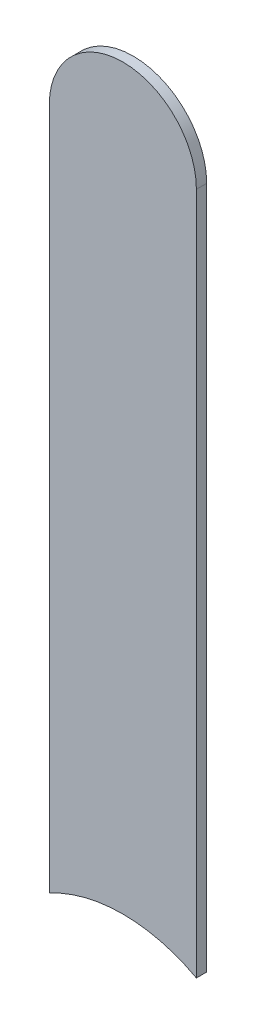
ISO-10303-21;
HEADER;
FILE_DESCRIPTION(('STEP AP214'),'2;1');
FILE_NAME('part.step','',(''),(''),'','','');
FILE_SCHEMA(('AUTOMOTIVE_DESIGN { 1 0 10303 214 1 1 1 1 }'));
ENDSEC;
DATA;
#1=APPLICATION_CONTEXT('core data for automotive mechanical design processes');
#2=APPLICATION_PROTOCOL_DEFINITION('international standard','automotive_design',2000,#1);
#3=PRODUCT_CONTEXT('',#1,'mechanical');
#4=PRODUCT('Part','Part','',(#3));
#5=PRODUCT_RELATED_PRODUCT_CATEGORY('part','',(#4));
#6=PRODUCT_DEFINITION_FORMATION('','',#4);
#7=PRODUCT_DEFINITION_CONTEXT('part definition',#1,'design');
#8=PRODUCT_DEFINITION('design','',#6,#7);
#9=PRODUCT_DEFINITION_SHAPE('','',#8);
#10=(LENGTH_UNIT() NAMED_UNIT(*) SI_UNIT(.MILLI.,.METRE.));
#11=(NAMED_UNIT(*) PLANE_ANGLE_UNIT() SI_UNIT($,.RADIAN.));
#12=(NAMED_UNIT(*) SI_UNIT($,.STERADIAN.) SOLID_ANGLE_UNIT());
#13=UNCERTAINTY_MEASURE_WITH_UNIT(LENGTH_MEASURE(1.E-05),#10,'distance_accuracy_value','');
#14=(GEOMETRIC_REPRESENTATION_CONTEXT(3) GLOBAL_UNCERTAINTY_ASSIGNED_CONTEXT((#13)) GLOBAL_UNIT_ASSIGNED_CONTEXT((#10,
#11,#12)) REPRESENTATION_CONTEXT('',''));
#15=CARTESIAN_POINT('',(0.,0.,0.));
#16=DIRECTION('',(0.,0.,1.));
#17=DIRECTION('',(1.,0.,0.));
#18=AXIS2_PLACEMENT_3D('',#15,#16,#17);
#19=CARTESIAN_POINT('',(129.102,-108.9,-0.035));
#20=DIRECTION('',(1.,0.,0.));
#21=DIRECTION('',(0.,1.,0.));
#22=AXIS2_PLACEMENT_3D('',#19,#20,#21);
#23=PLANE('',#22);
#24=DIRECTION('',(0.,0.,-1.));
#25=VECTOR('',#24,1.);
#26=CARTESIAN_POINT('',(129.102,-111.2223453671,-0.045));
#27=LINE('',#26,#25);
#28=CARTESIAN_POINT('',(129.102,-111.2223453671,0.));
#29=VERTEX_POINT('',#28);
#30=CARTESIAN_POINT('',(129.102,-111.2223453671,-0.035));
#31=VERTEX_POINT('',#30);
#32=EDGE_CURVE('E11',#29,#31,#27,.T.);
#33=ORIENTED_EDGE('',*,*,#32,.F.);
#34=DIRECTION('',(0.,-1.,0.));
#35=VECTOR('',#34,1.);
#36=CARTESIAN_POINT('',(129.102,-108.9,0.));
#37=LINE('',#36,#35);
#38=CARTESIAN_POINT('',(129.102,-108.9,0.));
#39=VERTEX_POINT('',#38);
#40=EDGE_CURVE('E20',#39,#29,#37,.T.);
#41=ORIENTED_EDGE('',*,*,#40,.F.);
#42=DIRECTION('',(0.,0.,1.));
#43=VECTOR('',#42,1.);
#44=CARTESIAN_POINT('',(129.102,-108.9,-0.035));
#45=LINE('',#44,#43);
#46=CARTESIAN_POINT('',(129.102,-108.9,-0.035));
#47=VERTEX_POINT('',#46);
#48=EDGE_CURVE('E52',#47,#39,#45,.T.);
#49=ORIENTED_EDGE('',*,*,#48,.F.);
#50=DIRECTION('',(0.,-1.,0.));
#51=VECTOR('',#50,1.);
#52=CARTESIAN_POINT('',(129.102,-108.9,-0.035));
#53=LINE('',#52,#51);
#54=EDGE_CURVE('E87',#47,#31,#53,.T.);
#55=ORIENTED_EDGE('',*,*,#54,.T.);
#56=EDGE_LOOP('',(#33,#41,#49,#55));
#57=FACE_BOUND('',#56,.T.);
#58=ADVANCED_FACE('F17',(#57),#23,.F.);
#59=CARTESIAN_POINT('',(129.352,-111.684,-0.045));
#60=DIRECTION('',(0.,0.,-1.));
#61=DIRECTION('',(0.,-1.,0.));
#62=AXIS2_PLACEMENT_3D('',#59,#60,#61);
#63=CYLINDRICAL_SURFACE('',#62,0.525);
#64=DIRECTION('',(0.,0.,-1.));
#65=VECTOR('',#64,1.);
#66=CARTESIAN_POINT('',(129.602,-111.2223453671,-0.045));
#67=LINE('',#66,#65);
#68=CARTESIAN_POINT('',(129.602,-111.2223453671,0.));
#69=VERTEX_POINT('',#68);
#70=CARTESIAN_POINT('',(129.602,-111.2223453671,-0.035));
#71=VERTEX_POINT('',#70);
#72=EDGE_CURVE('E97',#69,#71,#67,.T.);
#73=ORIENTED_EDGE('',*,*,#72,.F.);
#74=CARTESIAN_POINT('',(129.352,-111.684,0.));
#75=DIRECTION('',(0.,0.,-1.));
#76=DIRECTION('',(0.,-1.,0.));
#77=AXIS2_PLACEMENT_3D('',#74,#75,#76);
#78=CIRCLE('',#77,0.525);
#79=EDGE_CURVE('E71',#29,#69,#78,.T.);
#80=ORIENTED_EDGE('',*,*,#79,.F.);
#81=ORIENTED_EDGE('',*,*,#32,.T.);
#82=CARTESIAN_POINT('',(129.352,-111.684,-0.035));
#83=DIRECTION('',(0.,0.,-1.));
#84=DIRECTION('',(0.,-1.,0.));
#85=AXIS2_PLACEMENT_3D('',#82,#83,#84);
#86=CIRCLE('',#85,0.525);
#87=EDGE_CURVE('E60',#31,#71,#86,.T.);
#88=ORIENTED_EDGE('',*,*,#87,.T.);
#89=EDGE_LOOP('',(#73,#80,#81,#88));
#90=FACE_BOUND('',#89,.T.);
#91=ADVANCED_FACE('F124',(#90),#63,.F.);
#92=CARTESIAN_POINT('',(129.602,-111.684,0.));
#93=DIRECTION('',(0.,0.,1.));
#94=DIRECTION('',(1.,0.,0.));
#95=AXIS2_PLACEMENT_3D('',#92,#93,#94);
#96=PLANE('',#95);
#97=ORIENTED_EDGE('',*,*,#79,.T.);
#98=DIRECTION('',(0.,1.,0.));
#99=VECTOR('',#98,1.);
#100=CARTESIAN_POINT('',(129.602,-111.684,0.));
#101=LINE('',#100,#99);
#102=CARTESIAN_POINT('',(129.602,-108.9,0.));
#103=VERTEX_POINT('',#102);
#104=EDGE_CURVE('E103',#69,#103,#101,.T.);
#105=ORIENTED_EDGE('',*,*,#104,.T.);
#106=CARTESIAN_POINT('',(129.352,-108.9,0.));
#107=DIRECTION('',(0.,0.,1.));
#108=DIRECTION('',(1.,0.,0.));
#109=AXIS2_PLACEMENT_3D('',#106,#107,#108);
#110=CIRCLE('',#109,0.25);
#111=EDGE_CURVE('E101',#103,#39,#110,.T.);
#112=ORIENTED_EDGE('',*,*,#111,.T.);
#113=ORIENTED_EDGE('',*,*,#40,.T.);
#114=EDGE_LOOP('',(#97,#105,#112,#113));
#115=FACE_BOUND('',#114,.T.);
#116=ADVANCED_FACE('F122',(#115),#96,.T.);
#117=CARTESIAN_POINT('',(129.352,-108.9,-0.035));
#118=DIRECTION('',(0.,0.,-1.));
#119=DIRECTION('',(1.,0.,0.));
#120=AXIS2_PLACEMENT_3D('',#117,#118,#119);
#121=CYLINDRICAL_SURFACE('',#120,0.25);
#122=CARTESIAN_POINT('',(129.352,-108.9,-0.035));
#123=DIRECTION('',(0.,0.,1.));
#124=DIRECTION('',(1.,0.,0.));
#125=AXIS2_PLACEMENT_3D('',#122,#123,#124);
#126=CIRCLE('',#125,0.25);
#127=CARTESIAN_POINT('',(129.602,-108.9,-0.035));
#128=VERTEX_POINT('',#127);
#129=EDGE_CURVE('E82',#128,#47,#126,.T.);
#130=ORIENTED_EDGE('',*,*,#129,.T.);
#131=ORIENTED_EDGE('',*,*,#48,.T.);
#132=ORIENTED_EDGE('',*,*,#111,.F.);
#133=DIRECTION('',(0.,0.,1.));
#134=VECTOR('',#133,1.);
#135=CARTESIAN_POINT('',(129.602,-108.9,-0.035));
#136=LINE('',#135,#134);
#137=EDGE_CURVE('E96',#128,#103,#136,.T.);
#138=ORIENTED_EDGE('',*,*,#137,.F.);
#139=EDGE_LOOP('',(#130,#131,#132,#138));
#140=FACE_BOUND('',#139,.T.);
#141=ADVANCED_FACE('F100',(#140),#121,.T.);
#142=CARTESIAN_POINT('',(129.602,-111.684,-0.035));
#143=DIRECTION('',(0.,0.,1.));
#144=DIRECTION('',(1.,0.,0.));
#145=AXIS2_PLACEMENT_3D('',#142,#143,#144);
#146=PLANE('',#145);
#147=ORIENTED_EDGE('',*,*,#54,.F.);
#148=ORIENTED_EDGE('',*,*,#129,.F.);
#149=DIRECTION('',(0.,1.,0.));
#150=VECTOR('',#149,1.);
#151=CARTESIAN_POINT('',(129.602,-111.684,-0.035));
#152=LINE('',#151,#150);
#153=EDGE_CURVE('E85',#71,#128,#152,.T.);
#154=ORIENTED_EDGE('',*,*,#153,.F.);
#155=ORIENTED_EDGE('',*,*,#87,.F.);
#156=EDGE_LOOP('',(#147,#148,#154,#155));
#157=FACE_BOUND('',#156,.T.);
#158=ADVANCED_FACE('F84',(#157),#146,.F.);
#159=CARTESIAN_POINT('',(129.602,-111.684,-0.035));
#160=DIRECTION('',(-1.,0.,0.));
#161=DIRECTION('',(0.,0.,1.));
#162=AXIS2_PLACEMENT_3D('',#159,#160,#161);
#163=PLANE('',#162);
#164=ORIENTED_EDGE('',*,*,#137,.T.);
#165=ORIENTED_EDGE('',*,*,#104,.F.);
#166=ORIENTED_EDGE('',*,*,#72,.T.);
#167=ORIENTED_EDGE('',*,*,#153,.T.);
#168=EDGE_LOOP('',(#164,#165,#166,#167));
#169=FACE_BOUND('',#168,.T.);
#170=ADVANCED_FACE('F94',(#169),#163,.F.);
#171=CLOSED_SHELL('',(#58,#91,#116,#141,#158,#170));
#172=MANIFOLD_SOLID_BREP('B1',#171);
#173=ADVANCED_BREP_SHAPE_REPRESENTATION('',(#18,#172),#14);
#174=SHAPE_DEFINITION_REPRESENTATION(#9,#173);
ENDSEC;
END-ISO-10303-21;
